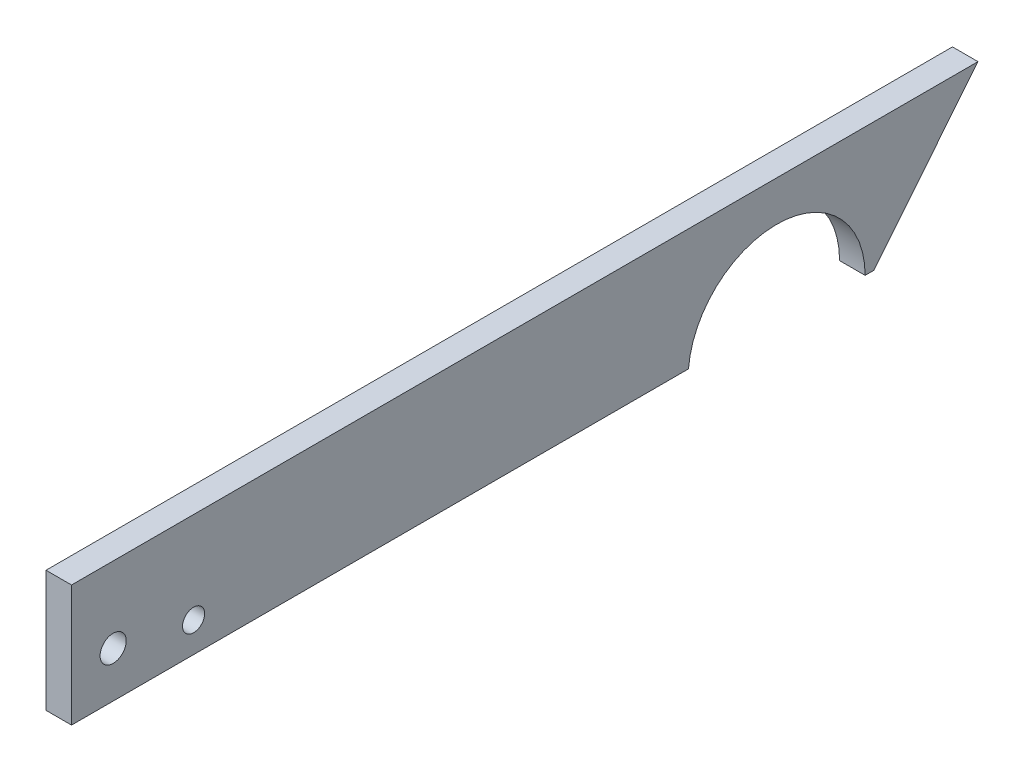
ISO-10303-21;
HEADER;
FILE_DESCRIPTION(('STEP AP214'),'2;1');
FILE_NAME('part.step','',(''),(''),'','','');
FILE_SCHEMA(('AUTOMOTIVE_DESIGN { 1 0 10303 214 1 1 1 1 }'));
ENDSEC;
DATA;
#1=APPLICATION_CONTEXT('core data for automotive mechanical design processes');
#2=APPLICATION_PROTOCOL_DEFINITION('international standard','automotive_design',2000,#1);
#3=PRODUCT_CONTEXT('',#1,'mechanical');
#4=PRODUCT('Part','Part','',(#3));
#5=PRODUCT_RELATED_PRODUCT_CATEGORY('part','',(#4));
#6=PRODUCT_DEFINITION_FORMATION('','',#4);
#7=PRODUCT_DEFINITION_CONTEXT('part definition',#1,'design');
#8=PRODUCT_DEFINITION('design','',#6,#7);
#9=PRODUCT_DEFINITION_SHAPE('','',#8);
#10=(LENGTH_UNIT() NAMED_UNIT(*) SI_UNIT(.MILLI.,.METRE.));
#11=(NAMED_UNIT(*) PLANE_ANGLE_UNIT() SI_UNIT($,.RADIAN.));
#12=(NAMED_UNIT(*) SI_UNIT($,.STERADIAN.) SOLID_ANGLE_UNIT());
#13=UNCERTAINTY_MEASURE_WITH_UNIT(LENGTH_MEASURE(1.E-05),#10,'distance_accuracy_value','');
#14=(GEOMETRIC_REPRESENTATION_CONTEXT(3) GLOBAL_UNCERTAINTY_ASSIGNED_CONTEXT((#13)) GLOBAL_UNIT_ASSIGNED_CONTEXT((#10,
#11,#12)) REPRESENTATION_CONTEXT('',''));
#15=CARTESIAN_POINT('',(0.,0.,0.));
#16=DIRECTION('',(0.,0.,1.));
#17=DIRECTION('',(1.,0.,0.));
#18=AXIS2_PLACEMENT_3D('',#15,#16,#17);
#19=CARTESIAN_POINT('',(6.35,0.,0.));
#20=DIRECTION('',(-1.,0.,0.));
#21=DIRECTION('',(0.,0.,1.));
#22=AXIS2_PLACEMENT_3D('',#19,#20,#21);
#23=PLANE('',#22);
#24=DIRECTION('',(0.,-1.,0.));
#25=VECTOR('',#24,1.);
#26=CARTESIAN_POINT('',(6.35,32.,175.353584657941));
#27=LINE('',#26,#25);
#28=CARTESIAN_POINT('',(6.35,32.,175.353584657941));
#29=VERTEX_POINT('',#28);
#30=CARTESIAN_POINT('',(6.35,1.81927805502746,175.353584657941));
#31=VERTEX_POINT('',#30);
#32=EDGE_CURVE('E134',#29,#31,#27,.T.);
#33=ORIENTED_EDGE('',*,*,#32,.T.);
#34=DIRECTION('',(0.,0.,-1.));
#35=VECTOR('',#34,1.);
#36=CARTESIAN_POINT('',(6.35,1.81927805502746,175.353584657941));
#37=LINE('',#36,#35);
#38=CARTESIAN_POINT('',(6.35,1.81927805502746,21.9246488537102));
#39=VERTEX_POINT('',#38);
#40=EDGE_CURVE('E91',#31,#39,#37,.T.);
#41=ORIENTED_EDGE('',*,*,#40,.T.);
#42=CARTESIAN_POINT('',(6.35,0.,0.));
#43=DIRECTION('',(-1.,0.,0.));
#44=DIRECTION('',(0.,0.,1.));
#45=AXIS2_PLACEMENT_3D('',#42,#43,#44);
#46=CIRCLE('',#45,22.);
#47=CARTESIAN_POINT('',(6.35,0.,-22.));
#48=VERTEX_POINT('',#47);
#49=EDGE_CURVE('E106',#39,#48,#46,.T.);
#50=ORIENTED_EDGE('',*,*,#49,.T.);
#51=DIRECTION('',(0.,0.,-1.));
#52=VECTOR('',#51,1.);
#53=CARTESIAN_POINT('',(6.35,0.,-24.1527150114601));
#54=LINE('',#53,#52);
#55=CARTESIAN_POINT('',(6.35,0.,-24.1527150114601));
#56=VERTEX_POINT('',#55);
#57=EDGE_CURVE('E99',#48,#56,#54,.T.);
#58=ORIENTED_EDGE('',*,*,#57,.T.);
#59=DIRECTION('',(0.,0.77708016752062,-0.629401631111745));
#60=VECTOR('',#59,1.);
#61=CARTESIAN_POINT('',(6.35,0.,-24.1527150114601));
#62=LINE('',#61,#60);
#63=CARTESIAN_POINT('',(6.35,32.,-50.0713435357705));
#64=VERTEX_POINT('',#63);
#65=EDGE_CURVE('E102',#56,#64,#62,.T.);
#66=ORIENTED_EDGE('',*,*,#65,.T.);
#67=DIRECTION('',(0.,0.,1.));
#68=VECTOR('',#67,1.);
#69=CARTESIAN_POINT('',(6.35,32.,175.353584657941));
#70=LINE('',#69,#68);
#71=EDGE_CURVE('E57',#64,#29,#70,.T.);
#72=ORIENTED_EDGE('',*,*,#71,.T.);
#73=EDGE_LOOP('',(#33,#41,#50,#58,#66,#72));
#74=FACE_BOUND('',#73,.T.);
#75=CARTESIAN_POINT('',(6.35,9.28714681109711,145.));
#76=DIRECTION('',(1.,0.,0.));
#77=DIRECTION('',(0.,0.,-1.));
#78=AXIS2_PLACEMENT_3D('',#75,#76,#77);
#79=CIRCLE('',#78,2.75000000000001);
#80=CARTESIAN_POINT('',(6.35,9.28714681109711,142.25));
#81=VERTEX_POINT('',#80);
#82=EDGE_CURVE('E126',#81,#81,#79,.T.);
#83=ORIENTED_EDGE('',*,*,#82,.F.);
#84=EDGE_LOOP('',(#83));
#85=FACE_BOUND('',#84,.T.);
#86=CARTESIAN_POINT('',(6.35,13.1796749003773,165.));
#87=DIRECTION('',(1.,0.,0.));
#88=DIRECTION('',(0.,0.,-1.));
#89=AXIS2_PLACEMENT_3D('',#86,#87,#88);
#90=CIRCLE('',#89,3.25000000000001);
#91=CARTESIAN_POINT('',(6.35,13.1796749003773,161.75));
#92=VERTEX_POINT('',#91);
#93=EDGE_CURVE('E176',#92,#92,#90,.T.);
#94=ORIENTED_EDGE('',*,*,#93,.F.);
#95=EDGE_LOOP('',(#94));
#96=FACE_BOUND('',#95,.T.);
#97=ADVANCED_FACE('F39',(#74,#85,#96),#23,.F.);
#98=CARTESIAN_POINT('',(0.,0.,0.));
#99=DIRECTION('',(-1.,0.,0.));
#100=DIRECTION('',(0.,0.,1.));
#101=AXIS2_PLACEMENT_3D('',#98,#99,#100);
#102=PLANE('',#101);
#103=CARTESIAN_POINT('',(0.,9.28714681109711,145.));
#104=DIRECTION('',(1.,0.,0.));
#105=DIRECTION('',(0.,0.,-1.));
#106=AXIS2_PLACEMENT_3D('',#103,#104,#105);
#107=CIRCLE('',#106,2.75000000000001);
#108=CARTESIAN_POINT('',(0.,9.28714681109711,142.25));
#109=VERTEX_POINT('',#108);
#110=EDGE_CURVE('E182',#109,#109,#107,.T.);
#111=ORIENTED_EDGE('',*,*,#110,.T.);
#112=EDGE_LOOP('',(#111));
#113=FACE_BOUND('',#112,.T.);
#114=DIRECTION('',(0.,-1.,0.));
#115=VECTOR('',#114,1.);
#116=CARTESIAN_POINT('',(0.,32.,175.353584657941));
#117=LINE('',#116,#115);
#118=CARTESIAN_POINT('',(0.,32.,175.353584657941));
#119=VERTEX_POINT('',#118);
#120=CARTESIAN_POINT('',(0.,1.81927805502746,175.353584657941));
#121=VERTEX_POINT('',#120);
#122=EDGE_CURVE('E123',#119,#121,#117,.T.);
#123=ORIENTED_EDGE('',*,*,#122,.F.);
#124=DIRECTION('',(0.,0.,1.));
#125=VECTOR('',#124,1.);
#126=CARTESIAN_POINT('',(0.,32.,175.353584657941));
#127=LINE('',#126,#125);
#128=CARTESIAN_POINT('',(0.,32.,-50.0713435357705));
#129=VERTEX_POINT('',#128);
#130=EDGE_CURVE('E84',#129,#119,#127,.T.);
#131=ORIENTED_EDGE('',*,*,#130,.F.);
#132=DIRECTION('',(0.,0.77708016752062,-0.629401631111745));
#133=VECTOR('',#132,1.);
#134=CARTESIAN_POINT('',(0.,0.,-24.1527150114601));
#135=LINE('',#134,#133);
#136=CARTESIAN_POINT('',(0.,0.,-24.1527150114601));
#137=VERTEX_POINT('',#136);
#138=EDGE_CURVE('E78',#137,#129,#135,.T.);
#139=ORIENTED_EDGE('',*,*,#138,.F.);
#140=DIRECTION('',(0.,0.,-1.));
#141=VECTOR('',#140,1.);
#142=CARTESIAN_POINT('',(0.,0.,-24.1527150114601));
#143=LINE('',#142,#141);
#144=CARTESIAN_POINT('',(0.,0.,-22.));
#145=VERTEX_POINT('',#144);
#146=EDGE_CURVE('E111',#145,#137,#143,.T.);
#147=ORIENTED_EDGE('',*,*,#146,.F.);
#148=CARTESIAN_POINT('',(0.,0.,0.));
#149=DIRECTION('',(-1.,0.,0.));
#150=DIRECTION('',(0.,0.,1.));
#151=AXIS2_PLACEMENT_3D('',#148,#149,#150);
#152=CIRCLE('',#151,22.);
#153=CARTESIAN_POINT('',(0.,1.81927805502746,21.9246488537102));
#154=VERTEX_POINT('',#153);
#155=EDGE_CURVE('E128',#154,#145,#152,.T.);
#156=ORIENTED_EDGE('',*,*,#155,.F.);
#157=DIRECTION('',(0.,0.,-1.));
#158=VECTOR('',#157,1.);
#159=CARTESIAN_POINT('',(0.,1.81927805502746,175.353584657941));
#160=LINE('',#159,#158);
#161=EDGE_CURVE('E130',#121,#154,#160,.T.);
#162=ORIENTED_EDGE('',*,*,#161,.F.);
#163=EDGE_LOOP('',(#123,#131,#139,#147,#156,#162));
#164=FACE_BOUND('',#163,.T.);
#165=CARTESIAN_POINT('',(0.,13.1796749003773,165.));
#166=DIRECTION('',(1.,0.,0.));
#167=DIRECTION('',(0.,0.,-1.));
#168=AXIS2_PLACEMENT_3D('',#165,#166,#167);
#169=CIRCLE('',#168,3.25000000000001);
#170=CARTESIAN_POINT('',(0.,13.1796749003773,161.75));
#171=VERTEX_POINT('',#170);
#172=EDGE_CURVE('E178',#171,#171,#169,.T.);
#173=ORIENTED_EDGE('',*,*,#172,.T.);
#174=EDGE_LOOP('',(#173));
#175=FACE_BOUND('',#174,.T.);
#176=ADVANCED_FACE('F145',(#113,#164,#175),#102,.T.);
#177=CARTESIAN_POINT('',(6.35,32.,175.353584657941));
#178=DIRECTION('',(0.,0.,-1.));
#179=DIRECTION('',(-1.,0.,0.));
#180=AXIS2_PLACEMENT_3D('',#177,#178,#179);
#181=PLANE('',#180);
#182=ORIENTED_EDGE('',*,*,#122,.T.);
#183=DIRECTION('',(-1.,0.,0.));
#184=VECTOR('',#183,1.);
#185=CARTESIAN_POINT('',(6.35,1.81927805502746,175.353584657941));
#186=LINE('',#185,#184);
#187=EDGE_CURVE('E11',#31,#121,#186,.T.);
#188=ORIENTED_EDGE('',*,*,#187,.F.);
#189=ORIENTED_EDGE('',*,*,#32,.F.);
#190=DIRECTION('',(-1.,0.,0.));
#191=VECTOR('',#190,1.);
#192=CARTESIAN_POINT('',(6.35,32.,175.353584657941));
#193=LINE('',#192,#191);
#194=EDGE_CURVE('E119',#29,#119,#193,.T.);
#195=ORIENTED_EDGE('',*,*,#194,.T.);
#196=EDGE_LOOP('',(#182,#188,#189,#195));
#197=FACE_BOUND('',#196,.T.);
#198=ADVANCED_FACE('F41',(#197),#181,.F.);
#199=CARTESIAN_POINT('',(6.35,1.81927805502746,175.353584657941));
#200=DIRECTION('',(0.,1.,0.));
#201=DIRECTION('',(0.,0.,1.));
#202=AXIS2_PLACEMENT_3D('',#199,#200,#201);
#203=PLANE('',#202);
#204=ORIENTED_EDGE('',*,*,#161,.T.);
#205=DIRECTION('',(-1.,0.,0.));
#206=VECTOR('',#205,1.);
#207=CARTESIAN_POINT('',(6.35,1.81927805502746,21.9246488537102));
#208=LINE('',#207,#206);
#209=EDGE_CURVE('E48',#39,#154,#208,.T.);
#210=ORIENTED_EDGE('',*,*,#209,.F.);
#211=ORIENTED_EDGE('',*,*,#40,.F.);
#212=ORIENTED_EDGE('',*,*,#187,.T.);
#213=EDGE_LOOP('',(#204,#210,#211,#212));
#214=FACE_BOUND('',#213,.T.);
#215=ADVANCED_FACE('F226',(#214),#203,.F.);
#216=CARTESIAN_POINT('',(6.35,0.,0.));
#217=DIRECTION('',(-1.,0.,0.));
#218=DIRECTION('',(0.,0.,1.));
#219=AXIS2_PLACEMENT_3D('',#216,#217,#218);
#220=CYLINDRICAL_SURFACE('',#219,22.);
#221=ORIENTED_EDGE('',*,*,#155,.T.);
#222=DIRECTION('',(-1.,0.,0.));
#223=VECTOR('',#222,1.);
#224=CARTESIAN_POINT('',(6.35,0.,-22.));
#225=LINE('',#224,#223);
#226=EDGE_CURVE('E113',#48,#145,#225,.T.);
#227=ORIENTED_EDGE('',*,*,#226,.F.);
#228=ORIENTED_EDGE('',*,*,#49,.F.);
#229=ORIENTED_EDGE('',*,*,#209,.T.);
#230=EDGE_LOOP('',(#221,#227,#228,#229));
#231=FACE_BOUND('',#230,.T.);
#232=ADVANCED_FACE('F143',(#231),#220,.F.);
#233=CARTESIAN_POINT('',(6.35,0.,-24.1527150114601));
#234=DIRECTION('',(0.,1.,0.));
#235=DIRECTION('',(0.,0.,1.));
#236=AXIS2_PLACEMENT_3D('',#233,#234,#235);
#237=PLANE('',#236);
#238=ORIENTED_EDGE('',*,*,#146,.T.);
#239=DIRECTION('',(-1.,0.,0.));
#240=VECTOR('',#239,1.);
#241=CARTESIAN_POINT('',(6.35,0.,-24.1527150114601));
#242=LINE('',#241,#240);
#243=EDGE_CURVE('E112',#56,#137,#242,.T.);
#244=ORIENTED_EDGE('',*,*,#243,.F.);
#245=ORIENTED_EDGE('',*,*,#57,.F.);
#246=ORIENTED_EDGE('',*,*,#226,.T.);
#247=EDGE_LOOP('',(#238,#244,#245,#246));
#248=FACE_BOUND('',#247,.T.);
#249=ADVANCED_FACE('F115',(#248),#237,.F.);
#250=CARTESIAN_POINT('',(6.35,0.,-24.1527150114601));
#251=DIRECTION('',(0.,0.629401631111745,0.77708016752062));
#252=DIRECTION('',(0.,-0.77708016752062,0.629401631111745));
#253=AXIS2_PLACEMENT_3D('',#250,#251,#252);
#254=PLANE('',#253);
#255=ORIENTED_EDGE('',*,*,#138,.T.);
#256=DIRECTION('',(-1.,0.,0.));
#257=VECTOR('',#256,1.);
#258=CARTESIAN_POINT('',(6.35,32.,-50.0713435357705));
#259=LINE('',#258,#257);
#260=EDGE_CURVE('E116',#64,#129,#259,.T.);
#261=ORIENTED_EDGE('',*,*,#260,.F.);
#262=ORIENTED_EDGE('',*,*,#65,.F.);
#263=ORIENTED_EDGE('',*,*,#243,.T.);
#264=EDGE_LOOP('',(#255,#261,#262,#263));
#265=FACE_BOUND('',#264,.T.);
#266=ADVANCED_FACE('F117',(#265),#254,.F.);
#267=CARTESIAN_POINT('',(6.35,32.,175.353584657941));
#268=DIRECTION('',(0.,-1.,0.));
#269=DIRECTION('',(0.,0.,-1.));
#270=AXIS2_PLACEMENT_3D('',#267,#268,#269);
#271=PLANE('',#270);
#272=ORIENTED_EDGE('',*,*,#130,.T.);
#273=ORIENTED_EDGE('',*,*,#194,.F.);
#274=ORIENTED_EDGE('',*,*,#71,.F.);
#275=ORIENTED_EDGE('',*,*,#260,.T.);
#276=EDGE_LOOP('',(#272,#273,#274,#275));
#277=FACE_BOUND('',#276,.T.);
#278=ADVANCED_FACE('F149',(#277),#271,.F.);
#279=CARTESIAN_POINT('',(6.35,9.28714681109711,145.));
#280=DIRECTION('',(-1.,0.,0.));
#281=DIRECTION('',(0.,0.,1.));
#282=AXIS2_PLACEMENT_3D('',#279,#280,#281);
#283=CYLINDRICAL_SURFACE('',#282,2.75000000000001);
#284=ORIENTED_EDGE('',*,*,#82,.T.);
#285=EDGE_LOOP('',(#284));
#286=FACE_BOUND('',#285,.T.);
#287=ORIENTED_EDGE('',*,*,#110,.F.);
#288=EDGE_LOOP('',(#287));
#289=FACE_BOUND('',#288,.T.);
#290=ADVANCED_FACE('F151',(#286,#289),#283,.F.);
#291=CARTESIAN_POINT('',(6.35,13.1796749003773,165.));
#292=DIRECTION('',(-1.,0.,0.));
#293=DIRECTION('',(0.,0.,1.));
#294=AXIS2_PLACEMENT_3D('',#291,#292,#293);
#295=CYLINDRICAL_SURFACE('',#294,3.25000000000001);
#296=ORIENTED_EDGE('',*,*,#93,.T.);
#297=EDGE_LOOP('',(#296));
#298=FACE_BOUND('',#297,.T.);
#299=ORIENTED_EDGE('',*,*,#172,.F.);
#300=EDGE_LOOP('',(#299));
#301=FACE_BOUND('',#300,.T.);
#302=ADVANCED_FACE('F160',(#298,#301),#295,.F.);
#303=CLOSED_SHELL('',(#97,#176,#198,#215,#232,#249,#266,#278,#290,#302));
#304=MANIFOLD_SOLID_BREP('B2',#303);
#305=ADVANCED_BREP_SHAPE_REPRESENTATION('',(#18,#304),#14);
#306=SHAPE_DEFINITION_REPRESENTATION(#9,#305);
ENDSEC;
END-ISO-10303-21;
